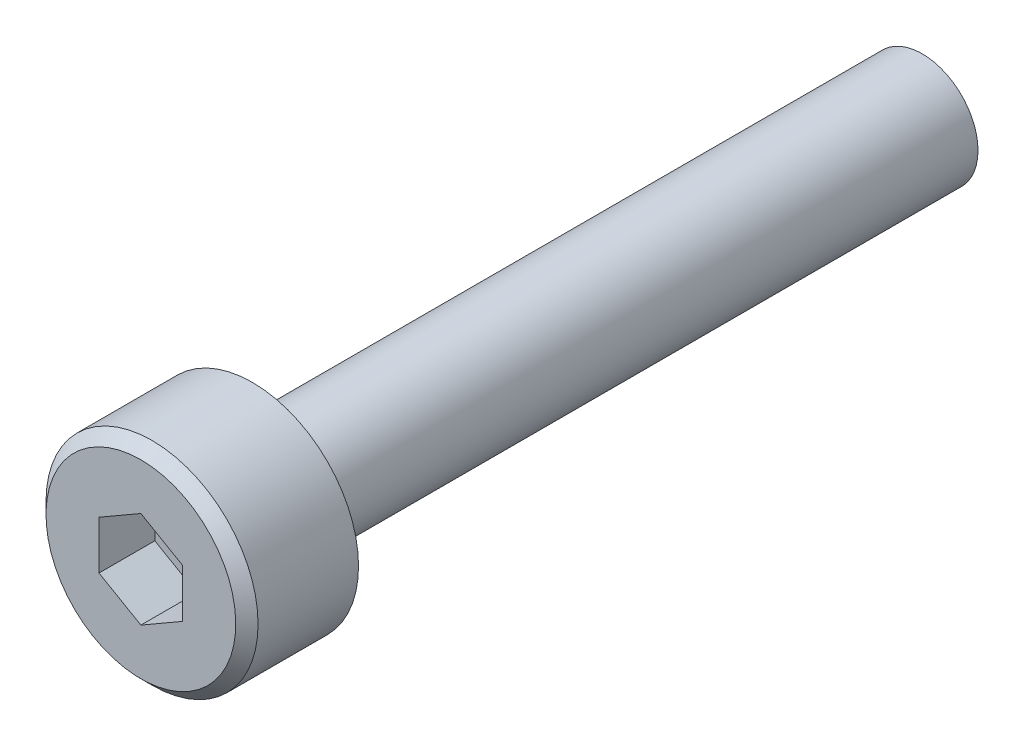
ISO-10303-21;
HEADER;
FILE_DESCRIPTION(('STEP AP214'),'2;1');
FILE_NAME('part.step','',(''),(''),'','','');
FILE_SCHEMA(('AUTOMOTIVE_DESIGN { 1 0 10303 214 1 1 1 1 }'));
ENDSEC;
DATA;
#1=APPLICATION_CONTEXT('core data for automotive mechanical design processes');
#2=APPLICATION_PROTOCOL_DEFINITION('international standard','automotive_design',2000,#1);
#3=PRODUCT_CONTEXT('',#1,'mechanical');
#4=PRODUCT('Part','Part','',(#3));
#5=PRODUCT_RELATED_PRODUCT_CATEGORY('part','',(#4));
#6=PRODUCT_DEFINITION_FORMATION('','',#4);
#7=PRODUCT_DEFINITION_CONTEXT('part definition',#1,'design');
#8=PRODUCT_DEFINITION('design','',#6,#7);
#9=PRODUCT_DEFINITION_SHAPE('','',#8);
#10=(LENGTH_UNIT() NAMED_UNIT(*) SI_UNIT(.MILLI.,.METRE.));
#11=(NAMED_UNIT(*) PLANE_ANGLE_UNIT() SI_UNIT($,.RADIAN.));
#12=(NAMED_UNIT(*) SI_UNIT($,.STERADIAN.) SOLID_ANGLE_UNIT());
#13=UNCERTAINTY_MEASURE_WITH_UNIT(LENGTH_MEASURE(1.E-05),#10,'distance_accuracy_value','');
#14=(GEOMETRIC_REPRESENTATION_CONTEXT(3) GLOBAL_UNCERTAINTY_ASSIGNED_CONTEXT((#13)) GLOBAL_UNIT_ASSIGNED_CONTEXT((#10,
#11,#12)) REPRESENTATION_CONTEXT('',''));
#15=CARTESIAN_POINT('',(0.,0.,0.));
#16=DIRECTION('',(0.,0.,1.));
#17=DIRECTION('',(1.,0.,0.));
#18=AXIS2_PLACEMENT_3D('',#15,#16,#17);
#19=CARTESIAN_POINT('',(0.,-0.866025403784439,1.));
#20=DIRECTION('',(0.,0.,1.));
#21=DIRECTION('',(1.,0.,0.));
#22=AXIS2_PLACEMENT_3D('',#19,#20,#21);
#23=PLANE('',#22);
#24=DIRECTION('',(-0.866025403784439,-0.5,0.));
#25=VECTOR('',#24,1.);
#26=CARTESIAN_POINT('',(0.,0.866025403784439,1.));
#27=LINE('',#26,#25);
#28=CARTESIAN_POINT('',(0.,0.866025403784439,1.));
#29=VERTEX_POINT('',#28);
#30=CARTESIAN_POINT('',(-0.750000000000001,0.433012701892219,1.));
#31=VERTEX_POINT('',#30);
#32=EDGE_CURVE('E68',#29,#31,#27,.T.);
#33=ORIENTED_EDGE('',*,*,#32,.T.);
#34=DIRECTION('',(0.,-1.,0.));
#35=VECTOR('',#34,1.);
#36=CARTESIAN_POINT('',(-0.750000000000001,0.433012701892219,1.));
#37=LINE('',#36,#35);
#38=CARTESIAN_POINT('',(-0.75,-0.43301270189222,1.));
#39=VERTEX_POINT('',#38);
#40=EDGE_CURVE('E70',#31,#39,#37,.T.);
#41=ORIENTED_EDGE('',*,*,#40,.T.);
#42=DIRECTION('',(0.866025403784439,-0.5,0.));
#43=VECTOR('',#42,1.);
#44=CARTESIAN_POINT('',(-0.75,-0.43301270189222,1.));
#45=LINE('',#44,#43);
#46=CARTESIAN_POINT('',(0.,-0.866025403784439,1.));
#47=VERTEX_POINT('',#46);
#48=EDGE_CURVE('E72',#39,#47,#45,.T.);
#49=ORIENTED_EDGE('',*,*,#48,.T.);
#50=DIRECTION('',(0.866025403784438,0.5,0.));
#51=VECTOR('',#50,1.);
#52=CARTESIAN_POINT('',(0.,-0.866025403784439,1.));
#53=LINE('',#52,#51);
#54=CARTESIAN_POINT('',(0.75,-0.433012701892219,1.));
#55=VERTEX_POINT('',#54);
#56=EDGE_CURVE('E123',#47,#55,#53,.T.);
#57=ORIENTED_EDGE('',*,*,#56,.T.);
#58=DIRECTION('',(0.,1.,0.));
#59=VECTOR('',#58,1.);
#60=CARTESIAN_POINT('',(0.75,-0.433012701892219,1.));
#61=LINE('',#60,#59);
#62=CARTESIAN_POINT('',(0.75,0.433012701892221,1.));
#63=VERTEX_POINT('',#62);
#64=EDGE_CURVE('E128',#55,#63,#61,.T.);
#65=ORIENTED_EDGE('',*,*,#64,.T.);
#66=DIRECTION('',(-0.866025403784439,0.5,0.));
#67=VECTOR('',#66,1.);
#68=CARTESIAN_POINT('',(0.749999999999999,0.433012701892221,1.));
#69=LINE('',#68,#67);
#70=EDGE_CURVE('E132',#63,#29,#69,.T.);
#71=ORIENTED_EDGE('',*,*,#70,.T.);
#72=EDGE_LOOP('',(#33,#41,#49,#57,#65,#71));
#73=FACE_BOUND('',#72,.T.);
#74=ADVANCED_FACE('F17',(#73),#23,.T.);
#75=CARTESIAN_POINT('',(-0.75,-0.43301270189222,1.));
#76=DIRECTION('',(-0.5,-0.866025403784439,0.));
#77=DIRECTION('',(0.866025403784439,-0.5,0.));
#78=AXIS2_PLACEMENT_3D('',#75,#76,#77);
#79=PLANE('',#78);
#80=DIRECTION('',(0.,0.,1.));
#81=VECTOR('',#80,1.);
#82=CARTESIAN_POINT('',(0.,-0.866025403784439,1.));
#83=LINE('',#82,#81);
#84=CARTESIAN_POINT('',(0.,-0.866025403784439,2.));
#85=VERTEX_POINT('',#84);
#86=EDGE_CURVE('E83',#85,#47,#83,.F.);
#87=ORIENTED_EDGE('',*,*,#86,.T.);
#88=ORIENTED_EDGE('',*,*,#48,.F.);
#89=DIRECTION('',(0.,0.,1.));
#90=VECTOR('',#89,1.);
#91=CARTESIAN_POINT('',(-0.75,-0.43301270189222,1.));
#92=LINE('',#91,#90);
#93=CARTESIAN_POINT('',(-0.75,-0.43301270189222,2.));
#94=VERTEX_POINT('',#93);
#95=EDGE_CURVE('E77',#39,#94,#92,.T.);
#96=ORIENTED_EDGE('',*,*,#95,.T.);
#97=DIRECTION('',(-0.866025403784439,0.5,0.));
#98=VECTOR('',#97,1.);
#99=CARTESIAN_POINT('',(0.,-0.866025403784439,2.));
#100=LINE('',#99,#98);
#101=EDGE_CURVE('E120',#85,#94,#100,.T.);
#102=ORIENTED_EDGE('',*,*,#101,.F.);
#103=EDGE_LOOP('',(#87,#88,#96,#102));
#104=FACE_BOUND('',#103,.T.);
#105=ADVANCED_FACE('F80',(#104),#79,.F.);
#106=CARTESIAN_POINT('',(-0.750000000000001,0.433012701892219,1.));
#107=DIRECTION('',(-1.,0.,0.));
#108=DIRECTION('',(0.,-1.,0.));
#109=AXIS2_PLACEMENT_3D('',#106,#107,#108);
#110=PLANE('',#109);
#111=ORIENTED_EDGE('',*,*,#95,.F.);
#112=ORIENTED_EDGE('',*,*,#40,.F.);
#113=DIRECTION('',(0.,0.,1.));
#114=VECTOR('',#113,1.);
#115=CARTESIAN_POINT('',(-0.750000000000001,0.433012701892219,1.));
#116=LINE('',#115,#114);
#117=CARTESIAN_POINT('',(-0.750000000000001,0.433012701892219,2.));
#118=VERTEX_POINT('',#117);
#119=EDGE_CURVE('E91',#31,#118,#116,.T.);
#120=ORIENTED_EDGE('',*,*,#119,.T.);
#121=DIRECTION('',(0.,1.,0.));
#122=VECTOR('',#121,1.);
#123=CARTESIAN_POINT('',(-0.75,0.,2.));
#124=LINE('',#123,#122);
#125=EDGE_CURVE('E88',#94,#118,#124,.T.);
#126=ORIENTED_EDGE('',*,*,#125,.F.);
#127=EDGE_LOOP('',(#111,#112,#120,#126));
#128=FACE_BOUND('',#127,.T.);
#129=ADVANCED_FACE('F86',(#128),#110,.F.);
#130=CARTESIAN_POINT('',(0.,0.866025403784439,1.));
#131=DIRECTION('',(-0.5,0.866025403784439,0.));
#132=DIRECTION('',(-0.866025403784439,-0.5,0.));
#133=AXIS2_PLACEMENT_3D('',#130,#131,#132);
#134=PLANE('',#133);
#135=ORIENTED_EDGE('',*,*,#119,.F.);
#136=ORIENTED_EDGE('',*,*,#32,.F.);
#137=DIRECTION('',(0.,0.,1.));
#138=VECTOR('',#137,1.);
#139=CARTESIAN_POINT('',(0.,0.866025403784439,1.));
#140=LINE('',#139,#138);
#141=CARTESIAN_POINT('',(0.,0.866025403784439,2.));
#142=VERTEX_POINT('',#141);
#143=EDGE_CURVE('E130',#29,#142,#140,.T.);
#144=ORIENTED_EDGE('',*,*,#143,.T.);
#145=DIRECTION('',(0.866025403784438,0.5,0.));
#146=VECTOR('',#145,1.);
#147=CARTESIAN_POINT('',(-0.750000000000001,0.433012701892219,2.));
#148=LINE('',#147,#146);
#149=EDGE_CURVE('E116',#118,#142,#148,.T.);
#150=ORIENTED_EDGE('',*,*,#149,.F.);
#151=EDGE_LOOP('',(#135,#136,#144,#150));
#152=FACE_BOUND('',#151,.T.);
#153=ADVANCED_FACE('F135',(#152),#134,.F.);
#154=CARTESIAN_POINT('',(0.749999999999999,0.433012701892221,1.));
#155=DIRECTION('',(0.5,0.866025403784439,0.));
#156=DIRECTION('',(-0.866025403784439,0.5,0.));
#157=AXIS2_PLACEMENT_3D('',#154,#155,#156);
#158=PLANE('',#157);
#159=ORIENTED_EDGE('',*,*,#143,.F.);
#160=ORIENTED_EDGE('',*,*,#70,.F.);
#161=DIRECTION('',(0.,0.,1.));
#162=VECTOR('',#161,1.);
#163=CARTESIAN_POINT('',(0.749999999999999,0.433012701892221,1.));
#164=LINE('',#163,#162);
#165=CARTESIAN_POINT('',(0.75,0.433012701892221,2.));
#166=VERTEX_POINT('',#165);
#167=EDGE_CURVE('E126',#63,#166,#164,.T.);
#168=ORIENTED_EDGE('',*,*,#167,.T.);
#169=DIRECTION('',(0.866025403784439,-0.5,0.));
#170=VECTOR('',#169,1.);
#171=CARTESIAN_POINT('',(0.,0.866025403784439,2.));
#172=LINE('',#171,#170);
#173=EDGE_CURVE('E113',#142,#166,#172,.T.);
#174=ORIENTED_EDGE('',*,*,#173,.F.);
#175=EDGE_LOOP('',(#159,#160,#168,#174));
#176=FACE_BOUND('',#175,.T.);
#177=ADVANCED_FACE('F147',(#176),#158,.F.);
#178=CARTESIAN_POINT('',(0.75,-0.433012701892219,1.));
#179=DIRECTION('',(1.,0.,0.));
#180=DIRECTION('',(0.,1.,0.));
#181=AXIS2_PLACEMENT_3D('',#178,#179,#180);
#182=PLANE('',#181);
#183=ORIENTED_EDGE('',*,*,#167,.F.);
#184=ORIENTED_EDGE('',*,*,#64,.F.);
#185=DIRECTION('',(0.,0.,1.));
#186=VECTOR('',#185,1.);
#187=CARTESIAN_POINT('',(0.75,-0.433012701892219,1.));
#188=LINE('',#187,#186);
#189=CARTESIAN_POINT('',(0.75,-0.433012701892219,2.));
#190=VERTEX_POINT('',#189);
#191=EDGE_CURVE('E35',#55,#190,#188,.T.);
#192=ORIENTED_EDGE('',*,*,#191,.T.);
#193=DIRECTION('',(0.,1.,0.));
#194=VECTOR('',#193,1.);
#195=CARTESIAN_POINT('',(0.749999999999999,0.,2.));
#196=LINE('',#195,#194);
#197=EDGE_CURVE('E110',#166,#190,#196,.F.);
#198=ORIENTED_EDGE('',*,*,#197,.F.);
#199=EDGE_LOOP('',(#183,#184,#192,#198));
#200=FACE_BOUND('',#199,.T.);
#201=ADVANCED_FACE('F145',(#200),#182,.F.);
#202=CARTESIAN_POINT('',(0.,-0.866025403784439,1.));
#203=DIRECTION('',(0.5,-0.866025403784438,0.));
#204=DIRECTION('',(0.866025403784438,0.5,0.));
#205=AXIS2_PLACEMENT_3D('',#202,#203,#204);
#206=PLANE('',#205);
#207=ORIENTED_EDGE('',*,*,#191,.F.);
#208=ORIENTED_EDGE('',*,*,#56,.F.);
#209=ORIENTED_EDGE('',*,*,#86,.F.);
#210=DIRECTION('',(-0.866025403784438,-0.500000000000001,0.));
#211=VECTOR('',#210,1.);
#212=CARTESIAN_POINT('',(0.75,-0.433012701892219,2.));
#213=LINE('',#212,#211);
#214=EDGE_CURVE('E106',#190,#85,#213,.T.);
#215=ORIENTED_EDGE('',*,*,#214,.F.);
#216=EDGE_LOOP('',(#207,#208,#209,#215));
#217=FACE_BOUND('',#216,.T.);
#218=ADVANCED_FACE('F142',(#217),#206,.F.);
#219=CARTESIAN_POINT('',(0.,0.,2.));
#220=DIRECTION('',(0.,0.,1.));
#221=DIRECTION('',(1.,0.,0.));
#222=AXIS2_PLACEMENT_3D('',#219,#220,#221);
#223=PLANE('',#222);
#224=ORIENTED_EDGE('',*,*,#197,.T.);
#225=ORIENTED_EDGE('',*,*,#214,.T.);
#226=ORIENTED_EDGE('',*,*,#101,.T.);
#227=ORIENTED_EDGE('',*,*,#125,.T.);
#228=ORIENTED_EDGE('',*,*,#149,.T.);
#229=ORIENTED_EDGE('',*,*,#173,.T.);
#230=EDGE_LOOP('',(#224,#225,#226,#227,#228,#229));
#231=FACE_BOUND('',#230,.T.);
#232=CARTESIAN_POINT('',(0.,0.,2.00000000000955));
#233=DIRECTION('',(0.,0.,-1.));
#234=DIRECTION('',(0.,1.,0.));
#235=AXIS2_PLACEMENT_3D('',#232,#233,#234);
#236=CIRCLE('',#235,1.70000000002801);
#237=CARTESIAN_POINT('',(0.,1.70000000002801,2.00000000000955));
#238=VERTEX_POINT('',#237);
#239=EDGE_CURVE('E20',#238,#238,#236,.T.);
#240=ORIENTED_EDGE('',*,*,#239,.F.);
#241=EDGE_LOOP('',(#240));
#242=FACE_BOUND('',#241,.T.);
#243=ADVANCED_FACE('F139',(#231,#242),#223,.T.);
#244=CARTESIAN_POINT('',(0.,0.,1.8000000001166));
#245=DIRECTION('',(0.,0.,-1.));
#246=DIRECTION('',(0.,1.,0.));
#247=AXIS2_PLACEMENT_3D('',#244,#245,#246);
#248=CONICAL_SURFACE('',#247,1.89999999992096,0.785398163397448);
#249=ORIENTED_EDGE('',*,*,#239,.T.);
#250=EDGE_LOOP('',(#249));
#251=FACE_BOUND('',#250,.T.);
#252=CARTESIAN_POINT('',(0.,0.,1.8));
#253=DIRECTION('',(0.,0.,-1.));
#254=DIRECTION('',(-1.,0.,0.));
#255=AXIS2_PLACEMENT_3D('',#252,#253,#254);
#256=CIRCLE('',#255,1.9);
#257=CARTESIAN_POINT('',(-1.9,0.,1.8));
#258=VERTEX_POINT('',#257);
#259=EDGE_CURVE('E98',#258,#258,#256,.T.);
#260=ORIENTED_EDGE('',*,*,#259,.F.);
#261=EDGE_LOOP('',(#260));
#262=FACE_BOUND('',#261,.T.);
#263=ADVANCED_FACE('F176',(#251,#262),#248,.T.);
#264=CARTESIAN_POINT('',(0.,0.,2.));
#265=DIRECTION('',(0.,0.,-1.));
#266=DIRECTION('',(-1.,0.,0.));
#267=AXIS2_PLACEMENT_3D('',#264,#265,#266);
#268=CYLINDRICAL_SURFACE('',#267,1.9);
#269=ORIENTED_EDGE('',*,*,#259,.T.);
#270=EDGE_LOOP('',(#269));
#271=FACE_BOUND('',#270,.T.);
#272=CARTESIAN_POINT('',(0.,0.,0.));
#273=DIRECTION('',(0.,0.,-1.));
#274=DIRECTION('',(-1.,0.,0.));
#275=AXIS2_PLACEMENT_3D('',#272,#273,#274);
#276=CIRCLE('',#275,1.9);
#277=CARTESIAN_POINT('',(-1.9,0.,0.));
#278=VERTEX_POINT('',#277);
#279=EDGE_CURVE('E96',#278,#278,#276,.F.);
#280=ORIENTED_EDGE('',*,*,#279,.T.);
#281=EDGE_LOOP('',(#280));
#282=FACE_BOUND('',#281,.T.);
#283=ADVANCED_FACE('F172',(#271,#282),#268,.T.);
#284=CARTESIAN_POINT('',(0.,0.,-12.));
#285=DIRECTION('',(0.,0.,1.));
#286=DIRECTION('',(1.,0.,0.));
#287=AXIS2_PLACEMENT_3D('',#284,#285,#286);
#288=PLANE('',#287);
#289=CARTESIAN_POINT('',(0.,0.,-12.));
#290=DIRECTION('',(0.,0.,1.));
#291=DIRECTION('',(1.,0.,0.));
#292=AXIS2_PLACEMENT_3D('',#289,#290,#291);
#293=CIRCLE('',#292,1.);
#294=CARTESIAN_POINT('',(1.,0.,-12.));
#295=VERTEX_POINT('',#294);
#296=EDGE_CURVE('E26',#295,#295,#293,.T.);
#297=ORIENTED_EDGE('',*,*,#296,.F.);
#298=EDGE_LOOP('',(#297));
#299=FACE_BOUND('',#298,.T.);
#300=ADVANCED_FACE('F165',(#299),#288,.F.);
#301=CARTESIAN_POINT('',(0.,0.,0.));
#302=DIRECTION('',(0.,0.,1.));
#303=DIRECTION('',(1.,0.,0.));
#304=AXIS2_PLACEMENT_3D('',#301,#302,#303);
#305=PLANE('',#304);
#306=ORIENTED_EDGE('',*,*,#279,.F.);
#307=EDGE_LOOP('',(#306));
#308=FACE_BOUND('',#307,.T.);
#309=CARTESIAN_POINT('',(0.,0.,0.));
#310=DIRECTION('',(0.,0.,1.));
#311=DIRECTION('',(1.,0.,0.));
#312=AXIS2_PLACEMENT_3D('',#309,#310,#311);
#313=CIRCLE('',#312,1.);
#314=CARTESIAN_POINT('',(1.,0.,0.));
#315=VERTEX_POINT('',#314);
#316=EDGE_CURVE('E11',#315,#315,#313,.F.);
#317=ORIENTED_EDGE('',*,*,#316,.F.);
#318=EDGE_LOOP('',(#317));
#319=FACE_BOUND('',#318,.T.);
#320=ADVANCED_FACE('F159',(#308,#319),#305,.F.);
#321=CARTESIAN_POINT('',(0.,0.,-12.));
#322=DIRECTION('',(0.,0.,1.));
#323=DIRECTION('',(1.,0.,0.));
#324=AXIS2_PLACEMENT_3D('',#321,#322,#323);
#325=CYLINDRICAL_SURFACE('',#324,1.);
#326=ORIENTED_EDGE('',*,*,#316,.T.);
#327=EDGE_LOOP('',(#326));
#328=FACE_BOUND('',#327,.T.);
#329=ORIENTED_EDGE('',*,*,#296,.T.);
#330=EDGE_LOOP('',(#329));
#331=FACE_BOUND('',#330,.T.);
#332=ADVANCED_FACE('F157',(#328,#331),#325,.T.);
#333=CLOSED_SHELL('',(#74,#105,#129,#153,#177,#201,#218,#243,#263,#283,#300,#320,#332));
#334=MANIFOLD_SOLID_BREP('B1',#333);
#335=ADVANCED_BREP_SHAPE_REPRESENTATION('',(#18,#334),#14);
#336=SHAPE_DEFINITION_REPRESENTATION(#9,#335);
ENDSEC;
END-ISO-10303-21;
